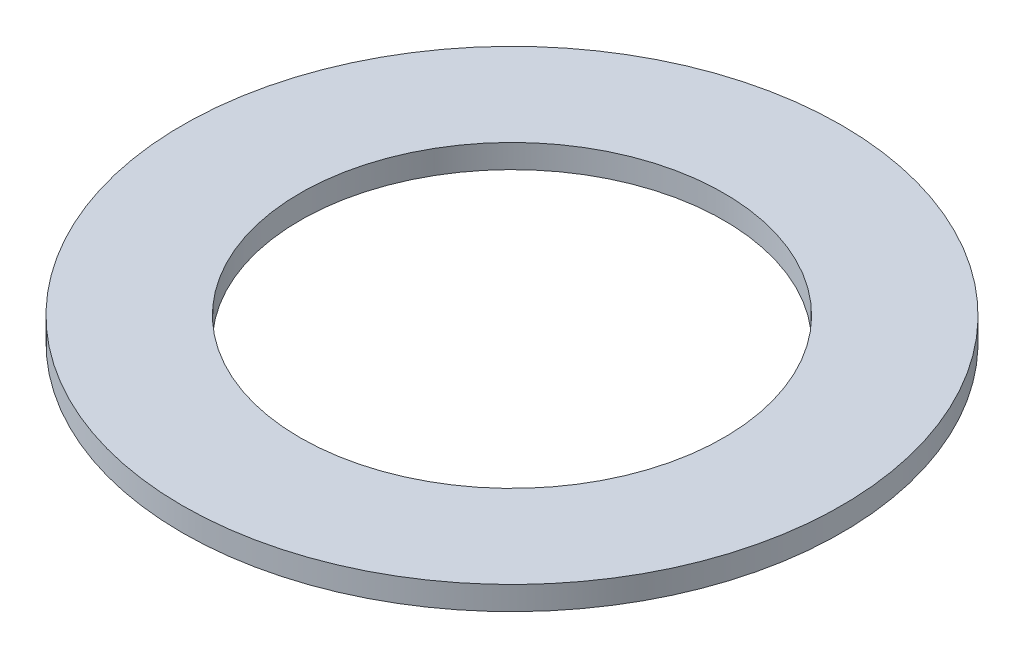
ISO-10303-21;
HEADER;
FILE_DESCRIPTION(('STEP AP214'),'2;1');
FILE_NAME('part.step','',(''),(''),'','','');
FILE_SCHEMA(('AUTOMOTIVE_DESIGN { 1 0 10303 214 1 1 1 1 }'));
ENDSEC;
DATA;
#1=APPLICATION_CONTEXT('core data for automotive mechanical design processes');
#2=APPLICATION_PROTOCOL_DEFINITION('international standard','automotive_design',2000,#1);
#3=PRODUCT_CONTEXT('',#1,'mechanical');
#4=PRODUCT('Part','Part','',(#3));
#5=PRODUCT_RELATED_PRODUCT_CATEGORY('part','',(#4));
#6=PRODUCT_DEFINITION_FORMATION('','',#4);
#7=PRODUCT_DEFINITION_CONTEXT('part definition',#1,'design');
#8=PRODUCT_DEFINITION('design','',#6,#7);
#9=PRODUCT_DEFINITION_SHAPE('','',#8);
#10=(LENGTH_UNIT() NAMED_UNIT(*) SI_UNIT(.MILLI.,.METRE.));
#11=(NAMED_UNIT(*) PLANE_ANGLE_UNIT() SI_UNIT($,.RADIAN.));
#12=(NAMED_UNIT(*) SI_UNIT($,.STERADIAN.) SOLID_ANGLE_UNIT());
#13=UNCERTAINTY_MEASURE_WITH_UNIT(LENGTH_MEASURE(1.E-05),#10,'distance_accuracy_value','');
#14=(GEOMETRIC_REPRESENTATION_CONTEXT(3) GLOBAL_UNCERTAINTY_ASSIGNED_CONTEXT((#13)) GLOBAL_UNIT_ASSIGNED_CONTEXT((#10,
#11,#12)) REPRESENTATION_CONTEXT('',''));
#15=CARTESIAN_POINT('',(0.,0.,0.));
#16=DIRECTION('',(0.,0.,1.));
#17=DIRECTION('',(1.,0.,0.));
#18=AXIS2_PLACEMENT_3D('',#15,#16,#17);
#19=CARTESIAN_POINT('',(0.,5.,0.));
#20=DIRECTION('',(0.,-1.,0.));
#21=DIRECTION('',(0.,0.,-1.));
#22=AXIS2_PLACEMENT_3D('',#19,#20,#21);
#23=CYLINDRICAL_SURFACE('',#22,70.);
#24=CARTESIAN_POINT('',(0.,5.,0.));
#25=DIRECTION('',(0.,1.,0.));
#26=DIRECTION('',(0.,0.,1.));
#27=AXIS2_PLACEMENT_3D('',#24,#25,#26);
#28=CIRCLE('',#27,70.);
#29=CARTESIAN_POINT('',(0.,5.,70.));
#30=VERTEX_POINT('',#29);
#31=EDGE_CURVE('E10',#30,#30,#28,.T.);
#32=ORIENTED_EDGE('',*,*,#31,.F.);
#33=EDGE_LOOP('',(#32));
#34=FACE_BOUND('',#33,.T.);
#35=CARTESIAN_POINT('',(0.,0.,0.));
#36=DIRECTION('',(0.,1.,0.));
#37=DIRECTION('',(0.,0.,1.));
#38=AXIS2_PLACEMENT_3D('',#35,#36,#37);
#39=CIRCLE('',#38,70.);
#40=CARTESIAN_POINT('',(0.,0.,70.));
#41=VERTEX_POINT('',#40);
#42=EDGE_CURVE('E37',#41,#41,#39,.T.);
#43=ORIENTED_EDGE('',*,*,#42,.T.);
#44=EDGE_LOOP('',(#43));
#45=FACE_BOUND('',#44,.T.);
#46=ADVANCED_FACE('F40',(#34,#45),#23,.T.);
#47=CARTESIAN_POINT('',(0.,5.,0.));
#48=DIRECTION('',(0.,1.,0.));
#49=DIRECTION('',(0.,0.,1.));
#50=AXIS2_PLACEMENT_3D('',#47,#48,#49);
#51=PLANE('',#50);
#52=CARTESIAN_POINT('',(0.,5.,0.));
#53=DIRECTION('',(0.,1.,0.));
#54=DIRECTION('',(0.,0.,1.));
#55=AXIS2_PLACEMENT_3D('',#52,#53,#54);
#56=CIRCLE('',#55,45.);
#57=CARTESIAN_POINT('',(0.,5.,45.));
#58=VERTEX_POINT('',#57);
#59=EDGE_CURVE('E50',#58,#58,#56,.T.);
#60=ORIENTED_EDGE('',*,*,#59,.F.);
#61=EDGE_LOOP('',(#60));
#62=FACE_BOUND('',#61,.T.);
#63=ORIENTED_EDGE('',*,*,#31,.T.);
#64=EDGE_LOOP('',(#63));
#65=FACE_BOUND('',#64,.T.);
#66=ADVANCED_FACE('F59',(#62,#65),#51,.T.);
#67=CARTESIAN_POINT('',(0.,0.,0.));
#68=DIRECTION('',(0.,1.,0.));
#69=DIRECTION('',(0.,0.,1.));
#70=AXIS2_PLACEMENT_3D('',#67,#68,#69);
#71=PLANE('',#70);
#72=CARTESIAN_POINT('',(0.,0.,0.));
#73=DIRECTION('',(0.,1.,0.));
#74=DIRECTION('',(0.,0.,1.));
#75=AXIS2_PLACEMENT_3D('',#72,#73,#74);
#76=CIRCLE('',#75,45.);
#77=CARTESIAN_POINT('',(0.,0.,45.));
#78=VERTEX_POINT('',#77);
#79=EDGE_CURVE('E47',#78,#78,#76,.T.);
#80=ORIENTED_EDGE('',*,*,#79,.T.);
#81=EDGE_LOOP('',(#80));
#82=FACE_BOUND('',#81,.T.);
#83=ORIENTED_EDGE('',*,*,#42,.F.);
#84=EDGE_LOOP('',(#83));
#85=FACE_BOUND('',#84,.T.);
#86=ADVANCED_FACE('F58',(#82,#85),#71,.F.);
#87=CARTESIAN_POINT('',(0.,5.,0.));
#88=DIRECTION('',(0.,-1.,0.));
#89=DIRECTION('',(0.,0.,-1.));
#90=AXIS2_PLACEMENT_3D('',#87,#88,#89);
#91=CYLINDRICAL_SURFACE('',#90,45.);
#92=ORIENTED_EDGE('',*,*,#59,.T.);
#93=EDGE_LOOP('',(#92));
#94=FACE_BOUND('',#93,.T.);
#95=ORIENTED_EDGE('',*,*,#79,.F.);
#96=EDGE_LOOP('',(#95));
#97=FACE_BOUND('',#96,.T.);
#98=ADVANCED_FACE('F54',(#94,#97),#91,.F.);
#99=CLOSED_SHELL('',(#46,#66,#86,#98));
#100=MANIFOLD_SOLID_BREP('B2',#99);
#101=ADVANCED_BREP_SHAPE_REPRESENTATION('',(#18,#100),#14);
#102=SHAPE_DEFINITION_REPRESENTATION(#9,#101);
ENDSEC;
END-ISO-10303-21;
